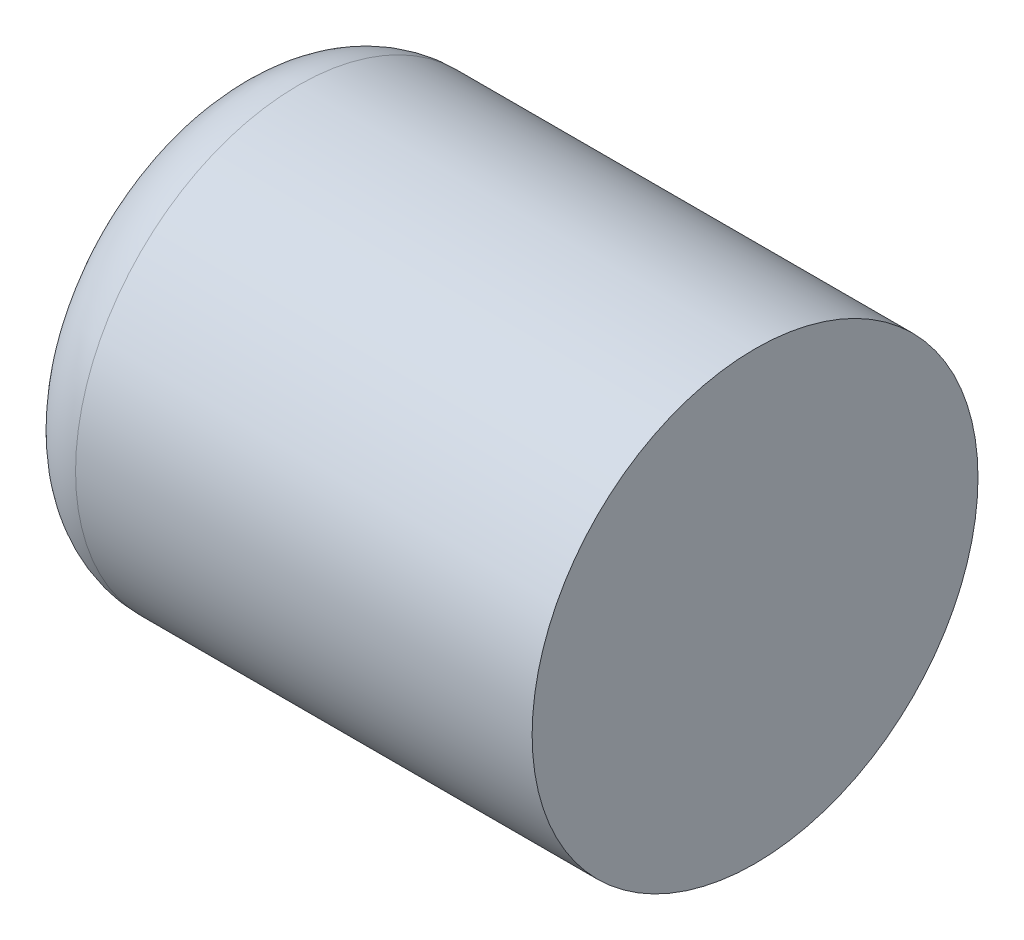
ISO-10303-21;
HEADER;
FILE_DESCRIPTION(('STEP AP214'),'2;1');
FILE_NAME('part.step','',(''),(''),'','','');
FILE_SCHEMA(('AUTOMOTIVE_DESIGN { 1 0 10303 214 1 1 1 1 }'));
ENDSEC;
DATA;
#1=APPLICATION_CONTEXT('core data for automotive mechanical design processes');
#2=APPLICATION_PROTOCOL_DEFINITION('international standard','automotive_design',2000,#1);
#3=PRODUCT_CONTEXT('',#1,'mechanical');
#4=PRODUCT('Part','Part','',(#3));
#5=PRODUCT_RELATED_PRODUCT_CATEGORY('part','',(#4));
#6=PRODUCT_DEFINITION_FORMATION('','',#4);
#7=PRODUCT_DEFINITION_CONTEXT('part definition',#1,'design');
#8=PRODUCT_DEFINITION('design','',#6,#7);
#9=PRODUCT_DEFINITION_SHAPE('','',#8);
#10=(LENGTH_UNIT() NAMED_UNIT(*) SI_UNIT(.MILLI.,.METRE.));
#11=(NAMED_UNIT(*) PLANE_ANGLE_UNIT() SI_UNIT($,.RADIAN.));
#12=(NAMED_UNIT(*) SI_UNIT($,.STERADIAN.) SOLID_ANGLE_UNIT());
#13=UNCERTAINTY_MEASURE_WITH_UNIT(LENGTH_MEASURE(1.E-05),#10,'distance_accuracy_value','');
#14=(GEOMETRIC_REPRESENTATION_CONTEXT(3) GLOBAL_UNCERTAINTY_ASSIGNED_CONTEXT((#13)) GLOBAL_UNIT_ASSIGNED_CONTEXT((#10,
#11,#12)) REPRESENTATION_CONTEXT('',''));
#15=CARTESIAN_POINT('',(0.,0.,0.));
#16=DIRECTION('',(0.,0.,1.));
#17=DIRECTION('',(1.,0.,0.));
#18=AXIS2_PLACEMENT_3D('',#15,#16,#17);
#19=CARTESIAN_POINT('',(-1.04936428530938,-0.332340218761648,0.1012));
#20=DIRECTION('',(1.,0.,0.));
#21=DIRECTION('',(0.,1.,0.));
#22=AXIS2_PLACEMENT_3D('',#19,#20,#21);
#23=PLANE('',#22);
#24=CARTESIAN_POINT('',(-1.04936428530938,-0.332340218761648,0.1012));
#25=DIRECTION('',(1.,0.,0.));
#26=DIRECTION('',(0.,0.,-1.));
#27=AXIS2_PLACEMENT_3D('',#24,#25,#26);
#28=CIRCLE('',#27,0.0212499999999999);
#29=CARTESIAN_POINT('',(-1.04936428530938,-0.332340218761648,0.0799500000000001));
#30=VERTEX_POINT('',#29);
#31=CARTESIAN_POINT('',(-1.04936428530938,-0.311090218761648,0.1012));
#32=VERTEX_POINT('',#31);
#33=EDGE_CURVE('E45',#30,#32,#28,.T.);
#34=ORIENTED_EDGE('',*,*,#33,.F.);
#35=CARTESIAN_POINT('',(-1.04936428530938,-0.332340218761648,0.1012));
#36=DIRECTION('',(1.,0.,0.));
#37=DIRECTION('',(0.,0.,1.));
#38=AXIS2_PLACEMENT_3D('',#35,#36,#37);
#39=CIRCLE('',#38,0.02125);
#40=CARTESIAN_POINT('',(-1.04936428530938,-0.332340218761648,0.12245));
#41=VERTEX_POINT('',#40);
#42=EDGE_CURVE('E43',#41,#30,#39,.T.);
#43=ORIENTED_EDGE('',*,*,#42,.F.);
#44=CARTESIAN_POINT('',(-1.04936428530938,-0.332340218761648,0.1012));
#45=DIRECTION('',(1.,0.,0.));
#46=DIRECTION('',(0.,1.,0.));
#47=AXIS2_PLACEMENT_3D('',#44,#45,#46);
#48=CIRCLE('',#47,0.02125);
#49=EDGE_CURVE('E38',#32,#41,#48,.T.);
#50=ORIENTED_EDGE('',*,*,#49,.F.);
#51=EDGE_LOOP('',(#34,#43,#50));
#52=FACE_BOUND('',#51,.T.);
#53=ADVANCED_FACE('F17',(#52),#23,.F.);
#54=CARTESIAN_POINT('',(-0.975364285309383,-0.332340218761648,0.1012));
#55=DIRECTION('',(-1.,0.,0.));
#56=DIRECTION('',(0.,-1.,0.));
#57=AXIS2_PLACEMENT_3D('',#54,#55,#56);
#58=PLANE('',#57);
#59=CARTESIAN_POINT('',(-0.975364285309383,-0.332340218761648,0.1012));
#60=DIRECTION('',(1.,0.,0.));
#61=DIRECTION('',(0.,1.,0.));
#62=AXIS2_PLACEMENT_3D('',#59,#60,#61);
#63=CIRCLE('',#62,0.03125);
#64=CARTESIAN_POINT('',(-0.975364285309383,-0.301090218761648,0.1012));
#65=VERTEX_POINT('',#64);
#66=EDGE_CURVE('E29',#65,#65,#63,.F.);
#67=ORIENTED_EDGE('',*,*,#66,.F.);
#68=EDGE_LOOP('',(#67));
#69=FACE_BOUND('',#68,.T.);
#70=ADVANCED_FACE('F68',(#69),#58,.F.);
#71=CARTESIAN_POINT('',(-1.03936428530938,-0.332340218761648,0.1012));
#72=DIRECTION('',(1.,0.,0.));
#73=DIRECTION('',(0.,0.,1.));
#74=AXIS2_PLACEMENT_3D('',#71,#72,#73);
#75=TOROIDAL_SURFACE('',#74,0.02125,0.01);
#76=CARTESIAN_POINT('',(-1.03936428530938,-0.332340218761648,0.1012));
#77=DIRECTION('',(1.,0.,0.));
#78=DIRECTION('',(0.,1.,0.));
#79=AXIS2_PLACEMENT_3D('',#76,#77,#78);
#80=CIRCLE('',#79,0.03125);
#81=CARTESIAN_POINT('',(-1.03936428530938,-0.301090218761648,0.1012));
#82=VERTEX_POINT('',#81);
#83=EDGE_CURVE('E11',#82,#82,#80,.T.);
#84=ORIENTED_EDGE('',*,*,#83,.F.);
#85=EDGE_LOOP('',(#84));
#86=FACE_BOUND('',#85,.T.);
#87=ORIENTED_EDGE('',*,*,#33,.T.);
#88=ORIENTED_EDGE('',*,*,#49,.T.);
#89=ORIENTED_EDGE('',*,*,#42,.T.);
#90=EDGE_LOOP('',(#87,#88,#89));
#91=FACE_BOUND('',#90,.T.);
#92=ADVANCED_FACE('F50',(#86,#91),#75,.T.);
#93=CARTESIAN_POINT('',(-0.945364285309383,-0.332340218761648,0.1012));
#94=DIRECTION('',(1.,0.,0.));
#95=DIRECTION('',(0.,1.,0.));
#96=AXIS2_PLACEMENT_3D('',#93,#94,#95);
#97=CYLINDRICAL_SURFACE('',#96,0.03125);
#98=ORIENTED_EDGE('',*,*,#66,.T.);
#99=EDGE_LOOP('',(#98));
#100=FACE_BOUND('',#99,.T.);
#101=ORIENTED_EDGE('',*,*,#83,.T.);
#102=EDGE_LOOP('',(#101));
#103=FACE_BOUND('',#102,.T.);
#104=ADVANCED_FACE('F67',(#100,#103),#97,.T.);
#105=CLOSED_SHELL('',(#53,#70,#92,#104));
#106=MANIFOLD_SOLID_BREP('B1',#105);
#107=ADVANCED_BREP_SHAPE_REPRESENTATION('',(#18,#106),#14);
#108=SHAPE_DEFINITION_REPRESENTATION(#9,#107);
ENDSEC;
END-ISO-10303-21;
